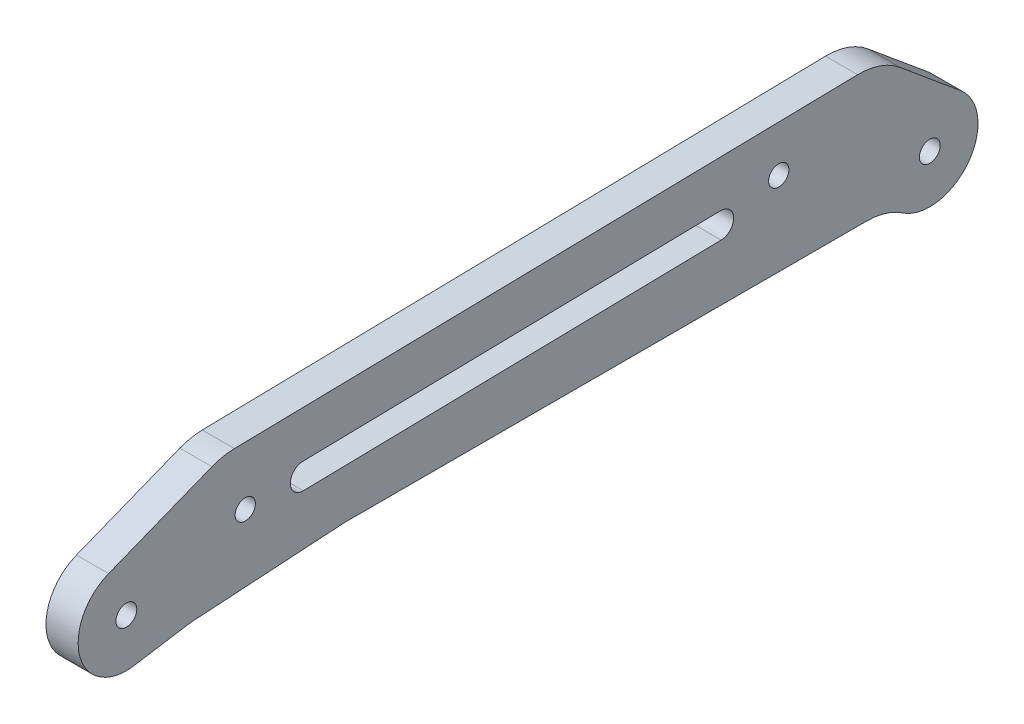
ISO-10303-21;
HEADER;
FILE_DESCRIPTION(('STEP AP214'),'2;1');
FILE_NAME('part.step','',(''),(''),'','','');
FILE_SCHEMA(('AUTOMOTIVE_DESIGN { 1 0 10303 214 1 1 1 1 }'));
ENDSEC;
DATA;
#1=APPLICATION_CONTEXT('core data for automotive mechanical design processes');
#2=APPLICATION_PROTOCOL_DEFINITION('international standard','automotive_design',2000,#1);
#3=PRODUCT_CONTEXT('',#1,'mechanical');
#4=PRODUCT('Part','Part','',(#3));
#5=PRODUCT_RELATED_PRODUCT_CATEGORY('part','',(#4));
#6=PRODUCT_DEFINITION_FORMATION('','',#4);
#7=PRODUCT_DEFINITION_CONTEXT('part definition',#1,'design');
#8=PRODUCT_DEFINITION('design','',#6,#7);
#9=PRODUCT_DEFINITION_SHAPE('','',#8);
#10=(LENGTH_UNIT() NAMED_UNIT(*) SI_UNIT(.MILLI.,.METRE.));
#11=(NAMED_UNIT(*) PLANE_ANGLE_UNIT() SI_UNIT($,.RADIAN.));
#12=(NAMED_UNIT(*) SI_UNIT($,.STERADIAN.) SOLID_ANGLE_UNIT());
#13=UNCERTAINTY_MEASURE_WITH_UNIT(LENGTH_MEASURE(1.E-05),#10,'distance_accuracy_value','');
#14=(GEOMETRIC_REPRESENTATION_CONTEXT(3) GLOBAL_UNCERTAINTY_ASSIGNED_CONTEXT((#13)) GLOBAL_UNIT_ASSIGNED_CONTEXT((#10,
#11,#12)) REPRESENTATION_CONTEXT('',''));
#15=CARTESIAN_POINT('',(0.,0.,0.));
#16=DIRECTION('',(0.,0.,1.));
#17=DIRECTION('',(1.,0.,0.));
#18=AXIS2_PLACEMENT_3D('',#15,#16,#17);
#19=CARTESIAN_POINT('',(2.5,-15.9506465412037,113.898149240446));
#20=DIRECTION('',(-1.,0.,0.));
#21=DIRECTION('',(0.,0.,1.));
#22=AXIS2_PLACEMENT_3D('',#19,#20,#21);
#23=CYLINDRICAL_SURFACE('',#22,9.99999999999999);
#24=DIRECTION('',(1.,0.,0.));
#25=VECTOR('',#24,1.);
#26=CARTESIAN_POINT('',(2.5,-6.0754365781553,115.473023262617));
#27=LINE('',#26,#25);
#28=CARTESIAN_POINT('',(-2.5,-6.0754365781553,115.473023262617));
#29=VERTEX_POINT('',#28);
#30=CARTESIAN_POINT('',(2.5,-6.0754365781553,115.473023262617));
#31=VERTEX_POINT('',#30);
#32=EDGE_CURVE('E211',#29,#31,#27,.T.);
#33=ORIENTED_EDGE('',*,*,#32,.F.);
#34=CARTESIAN_POINT('',(-2.5,-15.9506465412037,113.898149240446));
#35=DIRECTION('',(-1.,0.,0.));
#36=DIRECTION('',(0.,0.,1.));
#37=AXIS2_PLACEMENT_3D('',#34,#35,#36);
#38=CIRCLE('',#37,9.99999999999999);
#39=CARTESIAN_POINT('',(-2.5,-5.97012075637485,114.521932101997));
#40=VERTEX_POINT('',#39);
#41=EDGE_CURVE('E149',#29,#40,#38,.T.);
#42=ORIENTED_EDGE('',*,*,#41,.T.);
#43=DIRECTION('',(1.,0.,0.));
#44=VECTOR('',#43,1.);
#45=CARTESIAN_POINT('',(2.5,-5.97012075637486,114.521932101997));
#46=LINE('',#45,#44);
#47=CARTESIAN_POINT('',(2.5,-5.97012075637485,114.521932101997));
#48=VERTEX_POINT('',#47);
#49=EDGE_CURVE('E148',#40,#48,#46,.T.);
#50=ORIENTED_EDGE('',*,*,#49,.T.);
#51=CARTESIAN_POINT('',(2.5,-15.9506465412037,113.898149240446));
#52=DIRECTION('',(-1.,0.,0.));
#53=DIRECTION('',(0.,0.,1.));
#54=AXIS2_PLACEMENT_3D('',#51,#52,#53);
#55=CIRCLE('',#54,9.99999999999999);
#56=EDGE_CURVE('E20',#31,#48,#55,.T.);
#57=ORIENTED_EDGE('',*,*,#56,.F.);
#58=EDGE_LOOP('',(#33,#42,#50,#57));
#59=FACE_BOUND('',#58,.T.);
#60=ADVANCED_FACE('F17',(#59),#23,.F.);
#61=CARTESIAN_POINT('',(2.5,-14.5,90.687804581186));
#62=DIRECTION('',(1.,0.,0.));
#63=DIRECTION('',(0.,0.,-1.));
#64=AXIS2_PLACEMENT_3D('',#61,#62,#63);
#65=CYLINDRICAL_SURFACE('',#64,9.99999999999999);
#66=DIRECTION('',(1.,0.,0.));
#67=VECTOR('',#66,1.);
#68=CARTESIAN_POINT('',(2.5,-4.51947421517113,91.3115874427379));
#69=LINE('',#68,#67);
#70=CARTESIAN_POINT('',(2.5,-4.51947421517113,91.3115874427379));
#71=VERTEX_POINT('',#70);
#72=CARTESIAN_POINT('',(-2.5,-4.51947421517113,91.3115874427379));
#73=VERTEX_POINT('',#72);
#74=EDGE_CURVE('E153',#71,#73,#69,.F.);
#75=ORIENTED_EDGE('',*,*,#74,.T.);
#76=CARTESIAN_POINT('',(-2.5,-14.5,90.687804581186));
#77=DIRECTION('',(1.,0.,0.));
#78=DIRECTION('',(0.,0.,-1.));
#79=AXIS2_PLACEMENT_3D('',#76,#77,#78);
#80=CIRCLE('',#79,9.99999999999999);
#81=CARTESIAN_POINT('',(-2.5,-4.50000000000001,90.687804581186));
#82=VERTEX_POINT('',#81);
#83=EDGE_CURVE('E291',#73,#82,#80,.F.);
#84=ORIENTED_EDGE('',*,*,#83,.T.);
#85=DIRECTION('',(1.,0.,0.));
#86=VECTOR('',#85,1.);
#87=CARTESIAN_POINT('',(2.5,-4.50000000000001,90.687804581186));
#88=LINE('',#87,#86);
#89=CARTESIAN_POINT('',(2.5,-4.50000000000001,90.687804581186));
#90=VERTEX_POINT('',#89);
#91=EDGE_CURVE('E203',#82,#90,#88,.T.);
#92=ORIENTED_EDGE('',*,*,#91,.T.);
#93=CARTESIAN_POINT('',(2.5,-14.5,90.687804581186));
#94=DIRECTION('',(1.,0.,0.));
#95=DIRECTION('',(0.,0.,-1.));
#96=AXIS2_PLACEMENT_3D('',#93,#94,#95);
#97=CIRCLE('',#96,9.99999999999999);
#98=EDGE_CURVE('E146',#71,#90,#97,.F.);
#99=ORIENTED_EDGE('',*,*,#98,.F.);
#100=EDGE_LOOP('',(#75,#84,#92,#99));
#101=FACE_BOUND('',#100,.T.);
#102=ADVANCED_FACE('F296',(#101),#65,.F.);
#103=CARTESIAN_POINT('',(-2.5,0.,0.));
#104=DIRECTION('',(1.,0.,0.));
#105=DIRECTION('',(0.,0.,-1.));
#106=AXIS2_PLACEMENT_3D('',#103,#104,#105);
#107=PLANE('',#106);
#108=CARTESIAN_POINT('',(-2.5,0.,125.));
#109=DIRECTION('',(-1.,0.,0.));
#110=DIRECTION('',(0.,0.,1.));
#111=AXIS2_PLACEMENT_3D('',#108,#109,#110);
#112=CIRCLE('',#111,1.62500000000002);
#113=CARTESIAN_POINT('',(-2.5,0.,126.625));
#114=VERTEX_POINT('',#113);
#115=EDGE_CURVE('E273',#114,#114,#112,.F.);
#116=ORIENTED_EDGE('',*,*,#115,.T.);
#117=EDGE_LOOP('',(#116));
#118=FACE_BOUND('',#117,.T.);
#119=CARTESIAN_POINT('',(-2.5,8.49999999999999,23.5));
#120=DIRECTION('',(-1.,0.,0.));
#121=DIRECTION('',(0.,0.,1.));
#122=AXIS2_PLACEMENT_3D('',#119,#120,#121);
#123=CIRCLE('',#122,1.575);
#124=CARTESIAN_POINT('',(-2.5,8.49999999999999,25.075));
#125=VERTEX_POINT('',#124);
#126=EDGE_CURVE('E237',#125,#125,#123,.F.);
#127=ORIENTED_EDGE('',*,*,#126,.T.);
#128=EDGE_LOOP('',(#127));
#129=FACE_BOUND('',#128,.T.);
#130=DIRECTION('',(0.,-0.0195084817845967,0.99980969146056));
#131=VECTOR('',#130,1.);
#132=CARTESIAN_POINT('',(-2.5,8.89157621178074,0.173494169985969));
#133=LINE('',#132,#131);
#134=CARTESIAN_POINT('',(-2.5,8.25993313234433,32.545201991101));
#135=VERTEX_POINT('',#134);
#136=CARTESIAN_POINT('',(-2.5,6.99188181634555,97.5328319360374));
#137=VERTEX_POINT('',#136);
#138=EDGE_CURVE('E185',#135,#137,#133,.T.);
#139=ORIENTED_EDGE('',*,*,#138,.T.);
#140=CARTESIAN_POINT('',(-2.5,4.99226243342443,97.4938149724682));
#141=DIRECTION('',(-1.,0.,0.));
#142=DIRECTION('',(0.,0.,1.));
#143=AXIS2_PLACEMENT_3D('',#140,#141,#142);
#144=CIRCLE('',#143,2.);
#145=CARTESIAN_POINT('',(-2.5,2.99264305050331,97.454798008899));
#146=VERTEX_POINT('',#145);
#147=EDGE_CURVE('E182',#137,#146,#144,.F.);
#148=ORIENTED_EDGE('',*,*,#147,.T.);
#149=DIRECTION('',(0.,-0.0195084817845967,0.99980969146056));
#150=VECTOR('',#149,1.);
#151=CARTESIAN_POINT('',(-2.5,4.89233744593849,0.0954602428475822));
#152=LINE('',#151,#150);
#153=CARTESIAN_POINT('',(-2.5,4.26069436650209,32.4671680639626));
#154=VERTEX_POINT('',#153);
#155=EDGE_CURVE('E191',#154,#146,#152,.T.);
#156=ORIENTED_EDGE('',*,*,#155,.F.);
#157=CARTESIAN_POINT('',(-2.5,6.26031374942321,32.5061850275318));
#158=DIRECTION('',(-1.,0.,0.));
#159=DIRECTION('',(0.,0.,1.));
#160=AXIS2_PLACEMENT_3D('',#157,#158,#159);
#161=CIRCLE('',#160,2.);
#162=EDGE_CURVE('E240',#154,#135,#161,.F.);
#163=ORIENTED_EDGE('',*,*,#162,.T.);
#164=EDGE_LOOP('',(#139,#148,#156,#163));
#165=FACE_BOUND('',#164,.T.);
#166=CARTESIAN_POINT('',(-2.5,4.99999999999999,106.5));
#167=DIRECTION('',(-1.,0.,0.));
#168=DIRECTION('',(0.,0.,1.));
#169=AXIS2_PLACEMENT_3D('',#166,#167,#168);
#170=CIRCLE('',#169,1.57499999999999);
#171=CARTESIAN_POINT('',(-2.5,4.99999999999999,108.075));
#172=VERTEX_POINT('',#171);
#173=EDGE_CURVE('E195',#172,#172,#170,.F.);
#174=ORIENTED_EDGE('',*,*,#173,.T.);
#175=EDGE_LOOP('',(#174));
#176=FACE_BOUND('',#175,.T.);
#177=CARTESIAN_POINT('',(-2.5,5.92918080826999,11.03193188478));
#178=DIRECTION('',(-1.,0.,0.));
#179=DIRECTION('',(0.,0.,1.));
#180=AXIS2_PLACEMENT_3D('',#177,#178,#179);
#181=CIRCLE('',#180,10.);
#182=CARTESIAN_POINT('',(-2.5,13.6153297274053,4.63481419062464));
#183=VERTEX_POINT('',#182);
#184=CARTESIAN_POINT('',(-2.5,15.9272777228756,11.2270167026259));
#185=VERTEX_POINT('',#184);
#186=EDGE_CURVE('E230',#183,#185,#181,.F.);
#187=ORIENTED_EDGE('',*,*,#186,.F.);
#188=DIRECTION('',(0.,0.639711769415533,0.768614891913531));
#189=VECTOR('',#188,1.);
#190=CARTESIAN_POINT('',(-2.5,5.76461168935148,-4.79783827061649));
#191=LINE('',#190,#189);
#192=CARTESIAN_POINT('',(-2.5,5.76461168935148,-4.79783827061649));
#193=VERTEX_POINT('',#192);
#194=EDGE_CURVE('E234',#193,#183,#191,.T.);
#195=ORIENTED_EDGE('',*,*,#194,.F.);
#196=CARTESIAN_POINT('',(-2.5,0.,0.));
#197=DIRECTION('',(-1.,0.,0.));
#198=DIRECTION('',(0.,0.,1.));
#199=AXIS2_PLACEMENT_3D('',#196,#197,#198);
#200=CIRCLE('',#199,7.5);
#201=CARTESIAN_POINT('',(-2.5,-6.21428571428572,4.19912527334259));
#202=VERTEX_POINT('',#201);
#203=EDGE_CURVE('E196',#202,#193,#200,.F.);
#204=ORIENTED_EDGE('',*,*,#203,.F.);
#205=CARTESIAN_POINT('',(-2.5,-14.5,9.7979589711327));
#206=DIRECTION('',(-1.,0.,0.));
#207=DIRECTION('',(0.,0.,1.));
#208=AXIS2_PLACEMENT_3D('',#205,#206,#207);
#209=CIRCLE('',#208,10.);
#210=CARTESIAN_POINT('',(-2.5,-4.50000000000001,9.7979589711327));
#211=VERTEX_POINT('',#210);
#212=EDGE_CURVE('E202',#202,#211,#209,.F.);
#213=ORIENTED_EDGE('',*,*,#212,.T.);
#214=DIRECTION('',(0.,0.,1.));
#215=VECTOR('',#214,1.);
#216=CARTESIAN_POINT('',(-2.5,-4.50000000000001,0.));
#217=LINE('',#216,#215);
#218=EDGE_CURVE('E205',#211,#82,#217,.T.);
#219=ORIENTED_EDGE('',*,*,#218,.T.);
#220=ORIENTED_EDGE('',*,*,#83,.F.);
#221=DIRECTION('',(0.,-0.0623782861551807,0.998052578482889));
#222=VECTOR('',#221,1.);
#223=CARTESIAN_POINT('',(-2.5,1.18287937743191,0.0739299610894947));
#224=LINE('',#223,#222);
#225=EDGE_CURVE('E208',#73,#40,#224,.T.);
#226=ORIENTED_EDGE('',*,*,#225,.T.);
#227=ORIENTED_EDGE('',*,*,#41,.F.);
#228=DIRECTION('',(0.,0.157487402217094,-0.987520996304844));
#229=VECTOR('',#228,1.);
#230=CARTESIAN_POINT('',(-2.5,12.0338570705745,1.9191297155079));
#231=LINE('',#230,#229);
#232=CARTESIAN_POINT('',(-2.5,-7.40640747228635,123.818844483372));
#233=VERTEX_POINT('',#232);
#234=EDGE_CURVE('E213',#233,#29,#231,.T.);
#235=ORIENTED_EDGE('',*,*,#234,.F.);
#236=CARTESIAN_POINT('',(-2.5,0.,125.));
#237=DIRECTION('',(-1.,0.,0.));
#238=DIRECTION('',(0.,0.,1.));
#239=AXIS2_PLACEMENT_3D('',#236,#237,#238);
#240=CIRCLE('',#239,7.50000000000001);
#241=CARTESIAN_POINT('',(-2.5,6.97404582224044,127.759109434091));
#242=VERTEX_POINT('',#241);
#243=EDGE_CURVE('E217',#242,#233,#240,.F.);
#244=ORIENTED_EDGE('',*,*,#243,.F.);
#245=DIRECTION('',(0.,-0.367881257878812,0.929872776298727));
#246=VECTOR('',#245,1.);
#247=CARTESIAN_POINT('',(-2.5,49.7343916487453,19.6761869214032));
#248=LINE('',#247,#246);
#249=CARTESIAN_POINT('',(-2.5,13.3358502384639,111.678734019228));
#250=VERTEX_POINT('',#249);
#251=EDGE_CURVE('E218',#250,#242,#248,.T.);
#252=ORIENTED_EDGE('',*,*,#251,.F.);
#253=CARTESIAN_POINT('',(-2.5,4.0371224754766,107.99992144044));
#254=DIRECTION('',(-1.,0.,0.));
#255=DIRECTION('',(0.,0.,1.));
#256=AXIS2_PLACEMENT_3D('',#253,#254,#255);
#257=CIRCLE('',#256,9.99999999999999);
#258=CARTESIAN_POINT('',(-2.5,14.0352193900822,108.195006258286));
#259=VERTEX_POINT('',#258);
#260=EDGE_CURVE('E222',#259,#250,#257,.F.);
#261=ORIENTED_EDGE('',*,*,#260,.F.);
#262=DIRECTION('',(0.,-0.0195084817845964,0.99980969146056));
#263=VECTOR('',#262,1.);
#264=CARTESIAN_POINT('',(-2.5,16.1401964748698,0.31493066292429));
#265=LINE('',#264,#263);
#266=EDGE_CURVE('E226',#185,#259,#265,.T.);
#267=ORIENTED_EDGE('',*,*,#266,.F.);
#268=EDGE_LOOP('',(#187,#195,#204,#213,#219,#220,#226,#227,#235,#244,#252,#261,#267));
#269=FACE_BOUND('',#268,.T.);
#270=CARTESIAN_POINT('',(-2.5,0.,0.));
#271=DIRECTION('',(-1.,0.,0.));
#272=DIRECTION('',(0.,0.,1.));
#273=AXIS2_PLACEMENT_3D('',#270,#271,#272);
#274=CIRCLE('',#273,1.625);
#275=CARTESIAN_POINT('',(-2.5,0.,1.625));
#276=VERTEX_POINT('',#275);
#277=EDGE_CURVE('E242',#276,#276,#274,.F.);
#278=ORIENTED_EDGE('',*,*,#277,.T.);
#279=EDGE_LOOP('',(#278));
#280=FACE_BOUND('',#279,.T.);
#281=ADVANCED_FACE('F335',(#118,#129,#165,#176,#269,#280),#107,.F.);
#282=CARTESIAN_POINT('',(2.5,0.,0.));
#283=DIRECTION('',(-1.,0.,0.));
#284=DIRECTION('',(0.,0.,1.));
#285=AXIS2_PLACEMENT_3D('',#282,#283,#284);
#286=CYLINDRICAL_SURFACE('',#285,1.625);
#287=CARTESIAN_POINT('',(2.5,0.,0.));
#288=DIRECTION('',(-1.,0.,0.));
#289=DIRECTION('',(0.,0.,1.));
#290=AXIS2_PLACEMENT_3D('',#287,#288,#289);
#291=CIRCLE('',#290,1.625);
#292=CARTESIAN_POINT('',(2.5,0.,1.625));
#293=VERTEX_POINT('',#292);
#294=EDGE_CURVE('E178',#293,#293,#291,.T.);
#295=ORIENTED_EDGE('',*,*,#294,.F.);
#296=EDGE_LOOP('',(#295));
#297=FACE_BOUND('',#296,.T.);
#298=ORIENTED_EDGE('',*,*,#277,.F.);
#299=EDGE_LOOP('',(#298));
#300=FACE_BOUND('',#299,.T.);
#301=ADVANCED_FACE('F338',(#297,#300),#286,.F.);
#302=CARTESIAN_POINT('',(2.5,5.76461168935148,-4.79783827061649));
#303=DIRECTION('',(0.,0.768614891913531,-0.639711769415533));
#304=DIRECTION('',(0.,0.639711769415533,0.768614891913531));
#305=AXIS2_PLACEMENT_3D('',#302,#303,#304);
#306=PLANE('',#305);
#307=DIRECTION('',(0.,0.639711769415532,0.768614891913531));
#308=VECTOR('',#307,1.);
#309=CARTESIAN_POINT('',(2.5,5.76461168935148,-4.79783827061649));
#310=LINE('',#309,#308);
#311=CARTESIAN_POINT('',(2.5,5.76461168935148,-4.79783827061649));
#312=VERTEX_POINT('',#311);
#313=CARTESIAN_POINT('',(2.5,13.6153297274053,4.63481419062464));
#314=VERTEX_POINT('',#313);
#315=EDGE_CURVE('E175',#312,#314,#310,.T.);
#316=ORIENTED_EDGE('',*,*,#315,.F.);
#317=DIRECTION('',(-1.,0.,0.));
#318=VECTOR('',#317,1.);
#319=CARTESIAN_POINT('',(2.5,5.76461168935148,-4.79783827061649));
#320=LINE('',#319,#318);
#321=EDGE_CURVE('E192',#193,#312,#320,.F.);
#322=ORIENTED_EDGE('',*,*,#321,.F.);
#323=ORIENTED_EDGE('',*,*,#194,.T.);
#324=DIRECTION('',(-1.,0.,0.));
#325=VECTOR('',#324,1.);
#326=CARTESIAN_POINT('',(2.5,13.6153297274053,4.63481419062464));
#327=LINE('',#326,#325);
#328=EDGE_CURVE('E231',#314,#183,#327,.T.);
#329=ORIENTED_EDGE('',*,*,#328,.F.);
#330=EDGE_LOOP('',(#316,#322,#323,#329));
#331=FACE_BOUND('',#330,.T.);
#332=ADVANCED_FACE('F311',(#331),#306,.T.);
#333=CARTESIAN_POINT('',(2.5,5.92918080826999,11.03193188478));
#334=DIRECTION('',(-1.,0.,0.));
#335=DIRECTION('',(0.,0.,1.));
#336=AXIS2_PLACEMENT_3D('',#333,#334,#335);
#337=CYLINDRICAL_SURFACE('',#336,10.);
#338=ORIENTED_EDGE('',*,*,#186,.T.);
#339=DIRECTION('',(1.,0.,0.));
#340=VECTOR('',#339,1.);
#341=CARTESIAN_POINT('',(2.5,15.9272777228756,11.2270167026259));
#342=LINE('',#341,#340);
#343=CARTESIAN_POINT('',(2.5,15.9272777228756,11.2270167026259));
#344=VERTEX_POINT('',#343);
#345=EDGE_CURVE('E227',#344,#185,#342,.F.);
#346=ORIENTED_EDGE('',*,*,#345,.F.);
#347=CARTESIAN_POINT('',(2.5,5.92918080826999,11.03193188478));
#348=DIRECTION('',(-1.,0.,0.));
#349=DIRECTION('',(0.,0.,1.));
#350=AXIS2_PLACEMENT_3D('',#347,#348,#349);
#351=CIRCLE('',#350,10.);
#352=EDGE_CURVE('E174',#314,#344,#351,.F.);
#353=ORIENTED_EDGE('',*,*,#352,.F.);
#354=ORIENTED_EDGE('',*,*,#328,.T.);
#355=EDGE_LOOP('',(#338,#346,#353,#354));
#356=FACE_BOUND('',#355,.T.);
#357=ADVANCED_FACE('F315',(#356),#337,.T.);
#358=CARTESIAN_POINT('',(2.5,16.1401964748698,0.31493066292429));
#359=DIRECTION('',(0.,0.99980969146056,0.0195084817845964));
#360=DIRECTION('',(0.,-0.0195084817845964,0.99980969146056));
#361=AXIS2_PLACEMENT_3D('',#358,#359,#360);
#362=PLANE('',#361);
#363=ORIENTED_EDGE('',*,*,#266,.T.);
#364=DIRECTION('',(-1.,0.,0.));
#365=VECTOR('',#364,1.);
#366=CARTESIAN_POINT('',(2.5,14.0352193900822,108.195006258286));
#367=LINE('',#366,#365);
#368=CARTESIAN_POINT('',(2.5,14.0352193900822,108.195006258286));
#369=VERTEX_POINT('',#368);
#370=EDGE_CURVE('E223',#369,#259,#367,.T.);
#371=ORIENTED_EDGE('',*,*,#370,.F.);
#372=DIRECTION('',(0.,-0.0195084817845964,0.99980969146056));
#373=VECTOR('',#372,1.);
#374=CARTESIAN_POINT('',(2.5,15.9272777228756,11.2270167026259));
#375=LINE('',#374,#373);
#376=EDGE_CURVE('E171',#344,#369,#375,.T.);
#377=ORIENTED_EDGE('',*,*,#376,.F.);
#378=ORIENTED_EDGE('',*,*,#345,.T.);
#379=EDGE_LOOP('',(#363,#371,#377,#378));
#380=FACE_BOUND('',#379,.T.);
#381=ADVANCED_FACE('F319',(#380),#362,.T.);
#382=CARTESIAN_POINT('',(2.5,4.0371224754766,107.99992144044));
#383=DIRECTION('',(-1.,0.,0.));
#384=DIRECTION('',(0.,0.,1.));
#385=AXIS2_PLACEMENT_3D('',#382,#383,#384);
#386=CYLINDRICAL_SURFACE('',#385,9.99999999999999);
#387=ORIENTED_EDGE('',*,*,#260,.T.);
#388=DIRECTION('',(1.,0.,0.));
#389=VECTOR('',#388,1.);
#390=CARTESIAN_POINT('',(2.5,13.3358502384639,111.678734019228));
#391=LINE('',#390,#389);
#392=CARTESIAN_POINT('',(2.5,13.3358502384639,111.678734019228));
#393=VERTEX_POINT('',#392);
#394=EDGE_CURVE('E219',#393,#250,#391,.F.);
#395=ORIENTED_EDGE('',*,*,#394,.F.);
#396=CARTESIAN_POINT('',(2.5,4.0371224754766,107.99992144044));
#397=DIRECTION('',(-1.,0.,0.));
#398=DIRECTION('',(0.,0.,1.));
#399=AXIS2_PLACEMENT_3D('',#396,#397,#398);
#400=CIRCLE('',#399,9.99999999999999);
#401=EDGE_CURVE('E170',#369,#393,#400,.F.);
#402=ORIENTED_EDGE('',*,*,#401,.F.);
#403=ORIENTED_EDGE('',*,*,#370,.T.);
#404=EDGE_LOOP('',(#387,#395,#402,#403));
#405=FACE_BOUND('',#404,.T.);
#406=ADVANCED_FACE('F323',(#405),#386,.T.);
#407=CARTESIAN_POINT('',(2.5,49.7343916487453,19.6761869214032));
#408=DIRECTION('',(0.,0.929872776298727,0.367881257878812));
#409=DIRECTION('',(0.,-0.367881257878812,0.929872776298727));
#410=AXIS2_PLACEMENT_3D('',#407,#408,#409);
#411=PLANE('',#410);
#412=ORIENTED_EDGE('',*,*,#251,.T.);
#413=DIRECTION('',(-1.,0.,0.));
#414=VECTOR('',#413,1.);
#415=CARTESIAN_POINT('',(2.5,6.97404582224044,127.759109434091));
#416=LINE('',#415,#414);
#417=CARTESIAN_POINT('',(2.5,6.97404582224044,127.759109434091));
#418=VERTEX_POINT('',#417);
#419=EDGE_CURVE('E214',#418,#242,#416,.T.);
#420=ORIENTED_EDGE('',*,*,#419,.F.);
#421=DIRECTION('',(0.,-0.367881257878812,0.929872776298727));
#422=VECTOR('',#421,1.);
#423=CARTESIAN_POINT('',(2.5,13.3358502384639,111.678734019228));
#424=LINE('',#423,#422);
#425=EDGE_CURVE('E167',#393,#418,#424,.T.);
#426=ORIENTED_EDGE('',*,*,#425,.F.);
#427=ORIENTED_EDGE('',*,*,#394,.T.);
#428=EDGE_LOOP('',(#412,#420,#426,#427));
#429=FACE_BOUND('',#428,.T.);
#430=ADVANCED_FACE('F327',(#429),#411,.T.);
#431=CARTESIAN_POINT('',(2.5,0.,125.));
#432=DIRECTION('',(-1.,0.,0.));
#433=DIRECTION('',(0.,0.,1.));
#434=AXIS2_PLACEMENT_3D('',#431,#432,#433);
#435=CYLINDRICAL_SURFACE('',#434,7.50000000000001);
#436=ORIENTED_EDGE('',*,*,#243,.T.);
#437=DIRECTION('',(1.,0.,0.));
#438=VECTOR('',#437,1.);
#439=CARTESIAN_POINT('',(2.5,-7.40640747228635,123.818844483372));
#440=LINE('',#439,#438);
#441=CARTESIAN_POINT('',(2.5,-7.40640747228635,123.818844483372));
#442=VERTEX_POINT('',#441);
#443=EDGE_CURVE('E154',#442,#233,#440,.F.);
#444=ORIENTED_EDGE('',*,*,#443,.F.);
#445=CARTESIAN_POINT('',(2.5,0.,125.));
#446=DIRECTION('',(-1.,0.,0.));
#447=DIRECTION('',(0.,0.,1.));
#448=AXIS2_PLACEMENT_3D('',#445,#446,#447);
#449=CIRCLE('',#448,7.50000000000001);
#450=EDGE_CURVE('E163',#418,#442,#449,.F.);
#451=ORIENTED_EDGE('',*,*,#450,.F.);
#452=ORIENTED_EDGE('',*,*,#419,.T.);
#453=EDGE_LOOP('',(#436,#444,#451,#452));
#454=FACE_BOUND('',#453,.T.);
#455=ADVANCED_FACE('F331',(#454),#435,.T.);
#456=CARTESIAN_POINT('',(2.5,12.0338570705745,1.9191297155079));
#457=DIRECTION('',(0.,-0.987520996304844,-0.157487402217094));
#458=DIRECTION('',(0.,0.157487402217094,-0.987520996304844));
#459=AXIS2_PLACEMENT_3D('',#456,#457,#458);
#460=PLANE('',#459);
#461=DIRECTION('',(0.,0.157487402217095,-0.987520996304844));
#462=VECTOR('',#461,1.);
#463=CARTESIAN_POINT('',(2.5,-7.40640747228635,123.818844483372));
#464=LINE('',#463,#462);
#465=EDGE_CURVE('E145',#442,#31,#464,.T.);
#466=ORIENTED_EDGE('',*,*,#465,.F.);
#467=ORIENTED_EDGE('',*,*,#443,.T.);
#468=ORIENTED_EDGE('',*,*,#234,.T.);
#469=ORIENTED_EDGE('',*,*,#32,.T.);
#470=EDGE_LOOP('',(#466,#467,#468,#469));
#471=FACE_BOUND('',#470,.T.);
#472=ADVANCED_FACE('F333',(#471),#460,.T.);
#473=CARTESIAN_POINT('',(2.5,1.18287937743191,0.0739299610894947));
#474=DIRECTION('',(0.,0.998052578482889,0.0623782861551807));
#475=DIRECTION('',(0.,-0.0623782861551807,0.998052578482889));
#476=AXIS2_PLACEMENT_3D('',#473,#474,#475);
#477=PLANE('',#476);
#478=ORIENTED_EDGE('',*,*,#74,.F.);
#479=DIRECTION('',(0.,0.0623782861551807,-0.998052578482889));
#480=VECTOR('',#479,1.);
#481=CARTESIAN_POINT('',(2.5,-5.97012075637486,114.521932101997));
#482=LINE('',#481,#480);
#483=EDGE_CURVE('E143',#48,#71,#482,.T.);
#484=ORIENTED_EDGE('',*,*,#483,.F.);
#485=ORIENTED_EDGE('',*,*,#49,.F.);
#486=ORIENTED_EDGE('',*,*,#225,.F.);
#487=EDGE_LOOP('',(#478,#484,#485,#486));
#488=FACE_BOUND('',#487,.T.);
#489=ADVANCED_FACE('F157',(#488),#477,.F.);
#490=CARTESIAN_POINT('',(2.5,-4.50000000000001,0.));
#491=DIRECTION('',(0.,1.,0.));
#492=DIRECTION('',(0.,0.,1.));
#493=AXIS2_PLACEMENT_3D('',#490,#491,#492);
#494=PLANE('',#493);
#495=ORIENTED_EDGE('',*,*,#91,.F.);
#496=ORIENTED_EDGE('',*,*,#218,.F.);
#497=DIRECTION('',(-1.,0.,0.));
#498=VECTOR('',#497,1.);
#499=CARTESIAN_POINT('',(2.5,-4.50000000000001,9.7979589711327));
#500=LINE('',#499,#498);
#501=CARTESIAN_POINT('',(2.5,-4.50000000000001,9.7979589711327));
#502=VERTEX_POINT('',#501);
#503=EDGE_CURVE('E200',#211,#502,#500,.F.);
#504=ORIENTED_EDGE('',*,*,#503,.T.);
#505=DIRECTION('',(0.,0.,-1.));
#506=VECTOR('',#505,1.);
#507=CARTESIAN_POINT('',(2.5,-4.50000000000001,0.));
#508=LINE('',#507,#506);
#509=EDGE_CURVE('E158',#90,#502,#508,.T.);
#510=ORIENTED_EDGE('',*,*,#509,.F.);
#511=EDGE_LOOP('',(#495,#496,#504,#510));
#512=FACE_BOUND('',#511,.T.);
#513=ADVANCED_FACE('F300',(#512),#494,.F.);
#514=CARTESIAN_POINT('',(2.5,-14.5,9.7979589711327));
#515=DIRECTION('',(-1.,0.,0.));
#516=DIRECTION('',(0.,0.,1.));
#517=AXIS2_PLACEMENT_3D('',#514,#515,#516);
#518=CYLINDRICAL_SURFACE('',#517,10.);
#519=ORIENTED_EDGE('',*,*,#503,.F.);
#520=ORIENTED_EDGE('',*,*,#212,.F.);
#521=DIRECTION('',(-1.,0.,0.));
#522=VECTOR('',#521,1.);
#523=CARTESIAN_POINT('',(2.5,-6.21428571428572,4.19912527334258));
#524=LINE('',#523,#522);
#525=CARTESIAN_POINT('',(2.5,-6.21428571428572,4.19912527334258));
#526=VERTEX_POINT('',#525);
#527=EDGE_CURVE('E197',#526,#202,#524,.T.);
#528=ORIENTED_EDGE('',*,*,#527,.F.);
#529=CARTESIAN_POINT('',(2.5,-14.5,9.7979589711327));
#530=DIRECTION('',(-1.,0.,0.));
#531=DIRECTION('',(0.,0.,1.));
#532=AXIS2_PLACEMENT_3D('',#529,#530,#531);
#533=CIRCLE('',#532,10.);
#534=EDGE_CURVE('E161',#502,#526,#533,.T.);
#535=ORIENTED_EDGE('',*,*,#534,.F.);
#536=EDGE_LOOP('',(#519,#520,#528,#535));
#537=FACE_BOUND('',#536,.T.);
#538=ADVANCED_FACE('F304',(#537),#518,.F.);
#539=CARTESIAN_POINT('',(2.5,0.,0.));
#540=DIRECTION('',(-1.,0.,0.));
#541=DIRECTION('',(0.,0.,1.));
#542=AXIS2_PLACEMENT_3D('',#539,#540,#541);
#543=CYLINDRICAL_SURFACE('',#542,7.5);
#544=ORIENTED_EDGE('',*,*,#203,.T.);
#545=ORIENTED_EDGE('',*,*,#321,.T.);
#546=CARTESIAN_POINT('',(2.5,0.,0.));
#547=DIRECTION('',(-1.,0.,0.));
#548=DIRECTION('',(0.,0.,1.));
#549=AXIS2_PLACEMENT_3D('',#546,#547,#548);
#550=CIRCLE('',#549,7.5);
#551=EDGE_CURVE('E262',#526,#312,#550,.F.);
#552=ORIENTED_EDGE('',*,*,#551,.F.);
#553=ORIENTED_EDGE('',*,*,#527,.T.);
#554=EDGE_LOOP('',(#544,#545,#552,#553));
#555=FACE_BOUND('',#554,.T.);
#556=ADVANCED_FACE('F307',(#555),#543,.T.);
#557=CARTESIAN_POINT('',(2.5,4.99999999999999,106.5));
#558=DIRECTION('',(-1.,0.,0.));
#559=DIRECTION('',(0.,0.,1.));
#560=AXIS2_PLACEMENT_3D('',#557,#558,#559);
#561=CYLINDRICAL_SURFACE('',#560,1.57499999999999);
#562=CARTESIAN_POINT('',(2.5,4.99999999999999,106.5));
#563=DIRECTION('',(-1.,0.,0.));
#564=DIRECTION('',(0.,0.,1.));
#565=AXIS2_PLACEMENT_3D('',#562,#563,#564);
#566=CIRCLE('',#565,1.57499999999999);
#567=CARTESIAN_POINT('',(2.5,4.99999999999999,108.075));
#568=VERTEX_POINT('',#567);
#569=EDGE_CURVE('E259',#568,#568,#566,.T.);
#570=ORIENTED_EDGE('',*,*,#569,.F.);
#571=EDGE_LOOP('',(#570));
#572=FACE_BOUND('',#571,.T.);
#573=ORIENTED_EDGE('',*,*,#173,.F.);
#574=EDGE_LOOP('',(#573));
#575=FACE_BOUND('',#574,.T.);
#576=ADVANCED_FACE('F382',(#572,#575),#561,.F.);
#577=CARTESIAN_POINT('',(2.5,6.26031374942321,32.5061850275318));
#578=DIRECTION('',(-1.,0.,0.));
#579=DIRECTION('',(0.,0.,1.));
#580=AXIS2_PLACEMENT_3D('',#577,#578,#579);
#581=CYLINDRICAL_SURFACE('',#580,2.);
#582=DIRECTION('',(1.,0.,0.));
#583=VECTOR('',#582,1.);
#584=CARTESIAN_POINT('',(2.5,4.26069436650209,32.4671680639626));
#585=LINE('',#584,#583);
#586=CARTESIAN_POINT('',(2.5,4.26069436650209,32.4671680639626));
#587=VERTEX_POINT('',#586);
#588=EDGE_CURVE('E188',#587,#154,#585,.F.);
#589=ORIENTED_EDGE('',*,*,#588,.F.);
#590=CARTESIAN_POINT('',(2.5,6.26031374942321,32.5061850275318));
#591=DIRECTION('',(-1.,0.,0.));
#592=DIRECTION('',(0.,0.,1.));
#593=AXIS2_PLACEMENT_3D('',#590,#591,#592);
#594=CIRCLE('',#593,2.);
#595=CARTESIAN_POINT('',(2.5,8.25993313234433,32.545201991101));
#596=VERTEX_POINT('',#595);
#597=EDGE_CURVE('E256',#596,#587,#594,.T.);
#598=ORIENTED_EDGE('',*,*,#597,.F.);
#599=DIRECTION('',(1.,0.,0.));
#600=VECTOR('',#599,1.);
#601=CARTESIAN_POINT('',(2.5,8.25993313234433,32.545201991101));
#602=LINE('',#601,#600);
#603=EDGE_CURVE('E181',#596,#135,#602,.F.);
#604=ORIENTED_EDGE('',*,*,#603,.T.);
#605=ORIENTED_EDGE('',*,*,#162,.F.);
#606=EDGE_LOOP('',(#589,#598,#604,#605));
#607=FACE_BOUND('',#606,.T.);
#608=ADVANCED_FACE('F378',(#607),#581,.F.);
#609=CARTESIAN_POINT('',(2.5,4.89233744593849,0.0954602428475822));
#610=DIRECTION('',(0.,0.99980969146056,0.0195084817845967));
#611=DIRECTION('',(0.,-0.0195084817845967,0.99980969146056));
#612=AXIS2_PLACEMENT_3D('',#609,#610,#611);
#613=PLANE('',#612);
#614=DIRECTION('',(0.,-0.0195084817845967,0.99980969146056));
#615=VECTOR('',#614,1.);
#616=CARTESIAN_POINT('',(2.5,4.26069436650209,32.4671680639626));
#617=LINE('',#616,#615);
#618=CARTESIAN_POINT('',(2.5,2.99264305050331,97.454798008899));
#619=VERTEX_POINT('',#618);
#620=EDGE_CURVE('E255',#587,#619,#617,.T.);
#621=ORIENTED_EDGE('',*,*,#620,.F.);
#622=ORIENTED_EDGE('',*,*,#588,.T.);
#623=ORIENTED_EDGE('',*,*,#155,.T.);
#624=DIRECTION('',(-1.,0.,0.));
#625=VECTOR('',#624,1.);
#626=CARTESIAN_POINT('',(2.5,2.99264305050331,97.454798008899));
#627=LINE('',#626,#625);
#628=EDGE_CURVE('E186',#146,#619,#627,.F.);
#629=ORIENTED_EDGE('',*,*,#628,.T.);
#630=EDGE_LOOP('',(#621,#622,#623,#629));
#631=FACE_BOUND('',#630,.T.);
#632=ADVANCED_FACE('F374',(#631),#613,.T.);
#633=CARTESIAN_POINT('',(2.5,4.99226243342443,97.4938149724682));
#634=DIRECTION('',(-1.,0.,0.));
#635=DIRECTION('',(0.,0.,1.));
#636=AXIS2_PLACEMENT_3D('',#633,#634,#635);
#637=CYLINDRICAL_SURFACE('',#636,2.);
#638=DIRECTION('',(1.,0.,0.));
#639=VECTOR('',#638,1.);
#640=CARTESIAN_POINT('',(2.5,6.99188181634555,97.5328319360374));
#641=LINE('',#640,#639);
#642=CARTESIAN_POINT('',(2.5,6.99188181634555,97.5328319360374));
#643=VERTEX_POINT('',#642);
#644=EDGE_CURVE('E179',#137,#643,#641,.T.);
#645=ORIENTED_EDGE('',*,*,#644,.T.);
#646=CARTESIAN_POINT('',(2.5,4.99226243342443,97.4938149724682));
#647=DIRECTION('',(-1.,0.,0.));
#648=DIRECTION('',(0.,0.,1.));
#649=AXIS2_PLACEMENT_3D('',#646,#647,#648);
#650=CIRCLE('',#649,2.);
#651=EDGE_CURVE('E35',#619,#643,#650,.T.);
#652=ORIENTED_EDGE('',*,*,#651,.F.);
#653=ORIENTED_EDGE('',*,*,#628,.F.);
#654=ORIENTED_EDGE('',*,*,#147,.F.);
#655=EDGE_LOOP('',(#645,#652,#653,#654));
#656=FACE_BOUND('',#655,.T.);
#657=ADVANCED_FACE('F370',(#656),#637,.F.);
#658=CARTESIAN_POINT('',(2.5,8.89157621178074,0.173494169985969));
#659=DIRECTION('',(0.,0.99980969146056,0.0195084817845967));
#660=DIRECTION('',(0.,-0.0195084817845967,0.99980969146056));
#661=AXIS2_PLACEMENT_3D('',#658,#659,#660);
#662=PLANE('',#661);
#663=ORIENTED_EDGE('',*,*,#603,.F.);
#664=DIRECTION('',(0.,0.0195084817845967,-0.99980969146056));
#665=VECTOR('',#664,1.);
#666=CARTESIAN_POINT('',(2.5,6.99188181634555,97.5328319360374));
#667=LINE('',#666,#665);
#668=EDGE_CURVE('E253',#643,#596,#667,.T.);
#669=ORIENTED_EDGE('',*,*,#668,.F.);
#670=ORIENTED_EDGE('',*,*,#644,.F.);
#671=ORIENTED_EDGE('',*,*,#138,.F.);
#672=EDGE_LOOP('',(#663,#669,#670,#671));
#673=FACE_BOUND('',#672,.T.);
#674=ADVANCED_FACE('F366',(#673),#662,.F.);
#675=CARTESIAN_POINT('',(2.5,8.49999999999999,23.5));
#676=DIRECTION('',(-1.,0.,0.));
#677=DIRECTION('',(0.,0.,1.));
#678=AXIS2_PLACEMENT_3D('',#675,#676,#677);
#679=CYLINDRICAL_SURFACE('',#678,1.575);
#680=CARTESIAN_POINT('',(2.5,8.49999999999999,23.5));
#681=DIRECTION('',(-1.,0.,0.));
#682=DIRECTION('',(0.,0.,1.));
#683=AXIS2_PLACEMENT_3D('',#680,#681,#682);
#684=CIRCLE('',#683,1.575);
#685=CARTESIAN_POINT('',(2.5,8.49999999999999,25.075));
#686=VERTEX_POINT('',#685);
#687=EDGE_CURVE('E26',#686,#686,#684,.T.);
#688=ORIENTED_EDGE('',*,*,#687,.F.);
#689=EDGE_LOOP('',(#688));
#690=FACE_BOUND('',#689,.T.);
#691=ORIENTED_EDGE('',*,*,#126,.F.);
#692=EDGE_LOOP('',(#691));
#693=FACE_BOUND('',#692,.T.);
#694=ADVANCED_FACE('F359',(#690,#693),#679,.F.);
#695=CARTESIAN_POINT('',(2.5,0.,125.));
#696=DIRECTION('',(-1.,0.,0.));
#697=DIRECTION('',(0.,0.,1.));
#698=AXIS2_PLACEMENT_3D('',#695,#696,#697);
#699=CYLINDRICAL_SURFACE('',#698,1.62500000000002);
#700=CARTESIAN_POINT('',(2.5,0.,125.));
#701=DIRECTION('',(-1.,0.,0.));
#702=DIRECTION('',(0.,0.,1.));
#703=AXIS2_PLACEMENT_3D('',#700,#701,#702);
#704=CIRCLE('',#703,1.62500000000002);
#705=CARTESIAN_POINT('',(2.5,0.,126.625));
#706=VERTEX_POINT('',#705);
#707=EDGE_CURVE('E11',#706,#706,#704,.T.);
#708=ORIENTED_EDGE('',*,*,#707,.F.);
#709=EDGE_LOOP('',(#708));
#710=FACE_BOUND('',#709,.T.);
#711=ORIENTED_EDGE('',*,*,#115,.F.);
#712=EDGE_LOOP('',(#711));
#713=FACE_BOUND('',#712,.T.);
#714=ADVANCED_FACE('F353',(#710,#713),#699,.F.);
#715=CARTESIAN_POINT('',(2.5,0.,0.));
#716=DIRECTION('',(1.,0.,0.));
#717=DIRECTION('',(0.,0.,-1.));
#718=AXIS2_PLACEMENT_3D('',#715,#716,#717);
#719=PLANE('',#718);
#720=ORIENTED_EDGE('',*,*,#707,.T.);
#721=EDGE_LOOP('',(#720));
#722=FACE_BOUND('',#721,.T.);
#723=ORIENTED_EDGE('',*,*,#687,.T.);
#724=EDGE_LOOP('',(#723));
#725=FACE_BOUND('',#724,.T.);
#726=ORIENTED_EDGE('',*,*,#651,.T.);
#727=ORIENTED_EDGE('',*,*,#668,.T.);
#728=ORIENTED_EDGE('',*,*,#597,.T.);
#729=ORIENTED_EDGE('',*,*,#620,.T.);
#730=EDGE_LOOP('',(#726,#727,#728,#729));
#731=FACE_BOUND('',#730,.T.);
#732=ORIENTED_EDGE('',*,*,#569,.T.);
#733=EDGE_LOOP('',(#732));
#734=FACE_BOUND('',#733,.T.);
#735=ORIENTED_EDGE('',*,*,#534,.T.);
#736=ORIENTED_EDGE('',*,*,#551,.T.);
#737=ORIENTED_EDGE('',*,*,#315,.T.);
#738=ORIENTED_EDGE('',*,*,#352,.T.);
#739=ORIENTED_EDGE('',*,*,#376,.T.);
#740=ORIENTED_EDGE('',*,*,#401,.T.);
#741=ORIENTED_EDGE('',*,*,#425,.T.);
#742=ORIENTED_EDGE('',*,*,#450,.T.);
#743=ORIENTED_EDGE('',*,*,#465,.T.);
#744=ORIENTED_EDGE('',*,*,#56,.T.);
#745=ORIENTED_EDGE('',*,*,#483,.T.);
#746=ORIENTED_EDGE('',*,*,#98,.T.);
#747=ORIENTED_EDGE('',*,*,#509,.T.);
#748=EDGE_LOOP('',(#735,#736,#737,#738,#739,#740,#741,#742,#743,#744,#745,#746,#747));
#749=FACE_BOUND('',#748,.T.);
#750=ORIENTED_EDGE('',*,*,#294,.T.);
#751=EDGE_LOOP('',(#750));
#752=FACE_BOUND('',#751,.T.);
#753=ADVANCED_FACE('F140',(#722,#725,#731,#734,#749,#752),#719,.T.);
#754=CLOSED_SHELL('',(#60,#102,#281,#301,#332,#357,#381,#406,#430,#455,#472,#489,#513,#538,#556,
#576,#608,#632,#657,#674,#694,#714,#753));
#755=MANIFOLD_SOLID_BREP('B1',#754);
#756=ADVANCED_BREP_SHAPE_REPRESENTATION('',(#18,#755),#14);
#757=SHAPE_DEFINITION_REPRESENTATION(#9,#756);
ENDSEC;
END-ISO-10303-21;
